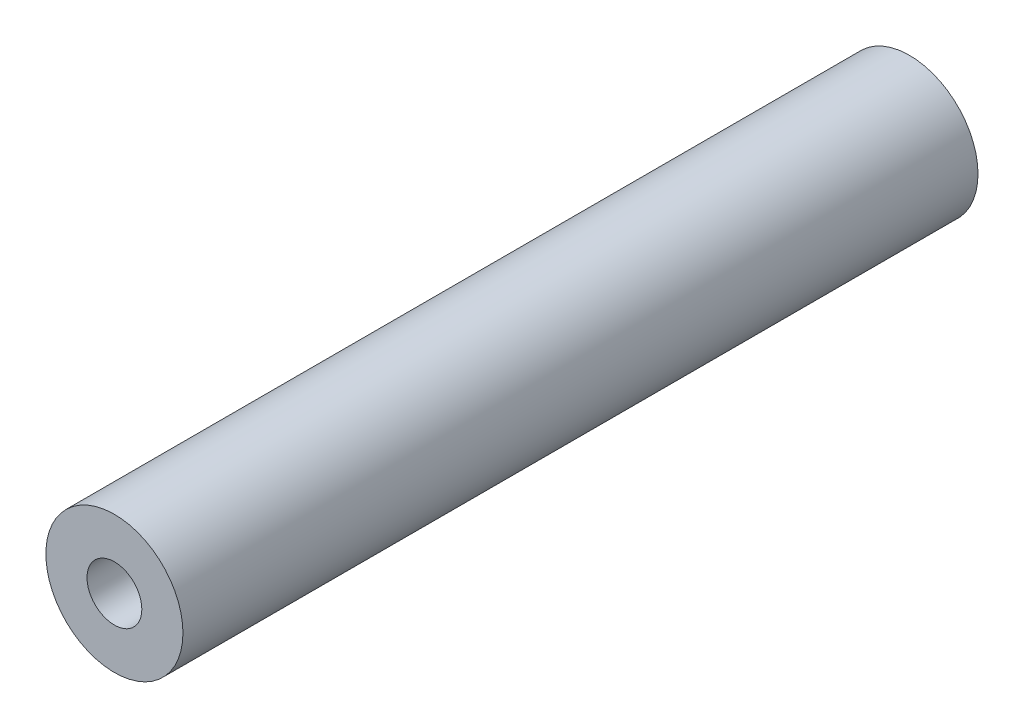
ISO-10303-21;
HEADER;
FILE_DESCRIPTION(('STEP AP214'),'2;1');
FILE_NAME('part.step','',(''),(''),'','','');
FILE_SCHEMA(('AUTOMOTIVE_DESIGN { 1 0 10303 214 1 1 1 1 }'));
ENDSEC;
DATA;
#1=APPLICATION_CONTEXT('core data for automotive mechanical design processes');
#2=APPLICATION_PROTOCOL_DEFINITION('international standard','automotive_design',2000,#1);
#3=PRODUCT_CONTEXT('',#1,'mechanical');
#4=PRODUCT('Part','Part','',(#3));
#5=PRODUCT_RELATED_PRODUCT_CATEGORY('part','',(#4));
#6=PRODUCT_DEFINITION_FORMATION('','',#4);
#7=PRODUCT_DEFINITION_CONTEXT('part definition',#1,'design');
#8=PRODUCT_DEFINITION('design','',#6,#7);
#9=PRODUCT_DEFINITION_SHAPE('','',#8);
#10=(LENGTH_UNIT() NAMED_UNIT(*) SI_UNIT(.MILLI.,.METRE.));
#11=(NAMED_UNIT(*) PLANE_ANGLE_UNIT() SI_UNIT($,.RADIAN.));
#12=(NAMED_UNIT(*) SI_UNIT($,.STERADIAN.) SOLID_ANGLE_UNIT());
#13=UNCERTAINTY_MEASURE_WITH_UNIT(LENGTH_MEASURE(1.E-05),#10,'distance_accuracy_value','');
#14=(GEOMETRIC_REPRESENTATION_CONTEXT(3) GLOBAL_UNCERTAINTY_ASSIGNED_CONTEXT((#13)) GLOBAL_UNIT_ASSIGNED_CONTEXT((#10,
#11,#12)) REPRESENTATION_CONTEXT('',''));
#15=CARTESIAN_POINT('',(0.,0.,0.));
#16=DIRECTION('',(0.,0.,1.));
#17=DIRECTION('',(1.,0.,0.));
#18=AXIS2_PLACEMENT_3D('',#15,#16,#17);
#19=CARTESIAN_POINT('',(4.60663443907317,-4.47114519086514,58.));
#20=DIRECTION('',(0.,0.,1.));
#21=DIRECTION('',(1.,0.,0.));
#22=AXIS2_PLACEMENT_3D('',#19,#20,#21);
#23=PLANE('',#22);
#24=CARTESIAN_POINT('',(4.60663443907317,-4.47114519086514,58.));
#25=DIRECTION('',(0.,0.,1.));
#26=DIRECTION('',(1.,0.,0.));
#27=AXIS2_PLACEMENT_3D('',#24,#25,#26);
#28=CIRCLE('',#27,5.);
#29=CARTESIAN_POINT('',(9.60663443907317,-4.47114519086514,58.));
#30=VERTEX_POINT('',#29);
#31=EDGE_CURVE('E10',#30,#30,#28,.T.);
#32=ORIENTED_EDGE('',*,*,#31,.T.);
#33=EDGE_LOOP('',(#32));
#34=FACE_BOUND('',#33,.T.);
#35=CARTESIAN_POINT('',(4.60663443907317,-4.47114519086514,58.));
#36=DIRECTION('',(0.,0.,1.));
#37=DIRECTION('',(1.,0.,0.));
#38=AXIS2_PLACEMENT_3D('',#35,#36,#37);
#39=CIRCLE('',#38,2.);
#40=CARTESIAN_POINT('',(6.60663443907317,-4.47114519086514,58.));
#41=VERTEX_POINT('',#40);
#42=EDGE_CURVE('E45',#41,#41,#39,.T.);
#43=ORIENTED_EDGE('',*,*,#42,.F.);
#44=EDGE_LOOP('',(#43));
#45=FACE_BOUND('',#44,.T.);
#46=ADVANCED_FACE('F34',(#34,#45),#23,.T.);
#47=CARTESIAN_POINT('',(4.60663443907317,-4.47114519086514,0.));
#48=DIRECTION('',(0.,0.,1.));
#49=DIRECTION('',(1.,0.,0.));
#50=AXIS2_PLACEMENT_3D('',#47,#48,#49);
#51=PLANE('',#50);
#52=CARTESIAN_POINT('',(4.60663443907317,-4.47114519086514,0.));
#53=DIRECTION('',(0.,0.,1.));
#54=DIRECTION('',(1.,0.,0.));
#55=AXIS2_PLACEMENT_3D('',#52,#53,#54);
#56=CIRCLE('',#55,5.);
#57=CARTESIAN_POINT('',(9.60663443907317,-4.47114519086514,0.));
#58=VERTEX_POINT('',#57);
#59=EDGE_CURVE('E38',#58,#58,#56,.T.);
#60=ORIENTED_EDGE('',*,*,#59,.F.);
#61=EDGE_LOOP('',(#60));
#62=FACE_BOUND('',#61,.T.);
#63=CARTESIAN_POINT('',(4.60663443907317,-4.47114519086514,0.));
#64=DIRECTION('',(0.,0.,1.));
#65=DIRECTION('',(1.,0.,0.));
#66=AXIS2_PLACEMENT_3D('',#63,#64,#65);
#67=CIRCLE('',#66,2.);
#68=CARTESIAN_POINT('',(6.60663443907317,-4.47114519086514,0.));
#69=VERTEX_POINT('',#68);
#70=EDGE_CURVE('E47',#69,#69,#67,.T.);
#71=ORIENTED_EDGE('',*,*,#70,.T.);
#72=EDGE_LOOP('',(#71));
#73=FACE_BOUND('',#72,.T.);
#74=ADVANCED_FACE('F57',(#62,#73),#51,.F.);
#75=CARTESIAN_POINT('',(4.60663443907317,-4.47114519086514,58.));
#76=DIRECTION('',(0.,0.,-1.));
#77=DIRECTION('',(-1.,0.,0.));
#78=AXIS2_PLACEMENT_3D('',#75,#76,#77);
#79=CYLINDRICAL_SURFACE('',#78,5.);
#80=ORIENTED_EDGE('',*,*,#31,.F.);
#81=EDGE_LOOP('',(#80));
#82=FACE_BOUND('',#81,.T.);
#83=ORIENTED_EDGE('',*,*,#59,.T.);
#84=EDGE_LOOP('',(#83));
#85=FACE_BOUND('',#84,.T.);
#86=ADVANCED_FACE('F36',(#82,#85),#79,.T.);
#87=CARTESIAN_POINT('',(4.60663443907317,-4.47114519086514,58.));
#88=DIRECTION('',(0.,0.,-1.));
#89=DIRECTION('',(-1.,0.,0.));
#90=AXIS2_PLACEMENT_3D('',#87,#88,#89);
#91=CYLINDRICAL_SURFACE('',#90,2.);
#92=ORIENTED_EDGE('',*,*,#42,.T.);
#93=EDGE_LOOP('',(#92));
#94=FACE_BOUND('',#93,.T.);
#95=ORIENTED_EDGE('',*,*,#70,.F.);
#96=EDGE_LOOP('',(#95));
#97=FACE_BOUND('',#96,.T.);
#98=ADVANCED_FACE('F53',(#94,#97),#91,.F.);
#99=CLOSED_SHELL('',(#46,#74,#86,#98));
#100=MANIFOLD_SOLID_BREP('B2',#99);
#101=ADVANCED_BREP_SHAPE_REPRESENTATION('',(#18,#100),#14);
#102=SHAPE_DEFINITION_REPRESENTATION(#9,#101);
ENDSEC;
END-ISO-10303-21;
